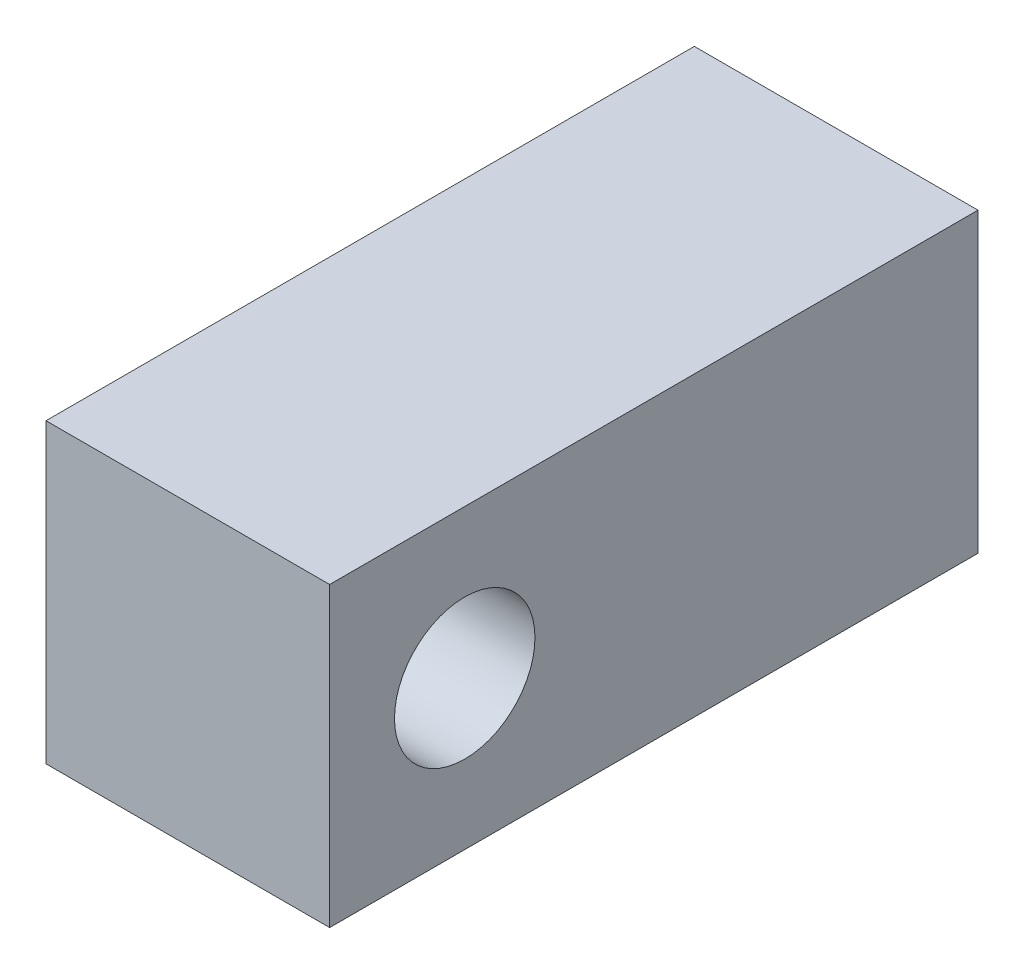
ISO-10303-21;
HEADER;
FILE_DESCRIPTION(('STEP AP214'),'2;1');
FILE_NAME('part.step','',(''),(''),'','','');
FILE_SCHEMA(('AUTOMOTIVE_DESIGN { 1 0 10303 214 1 1 1 1 }'));
ENDSEC;
DATA;
#1=APPLICATION_CONTEXT('core data for automotive mechanical design processes');
#2=APPLICATION_PROTOCOL_DEFINITION('international standard','automotive_design',2000,#1);
#3=PRODUCT_CONTEXT('',#1,'mechanical');
#4=PRODUCT('Part','Part','',(#3));
#5=PRODUCT_RELATED_PRODUCT_CATEGORY('part','',(#4));
#6=PRODUCT_DEFINITION_FORMATION('','',#4);
#7=PRODUCT_DEFINITION_CONTEXT('part definition',#1,'design');
#8=PRODUCT_DEFINITION('design','',#6,#7);
#9=PRODUCT_DEFINITION_SHAPE('','',#8);
#10=(LENGTH_UNIT() NAMED_UNIT(*) SI_UNIT(.MILLI.,.METRE.));
#11=(NAMED_UNIT(*) PLANE_ANGLE_UNIT() SI_UNIT($,.RADIAN.));
#12=(NAMED_UNIT(*) SI_UNIT($,.STERADIAN.) SOLID_ANGLE_UNIT());
#13=UNCERTAINTY_MEASURE_WITH_UNIT(LENGTH_MEASURE(1.E-05),#10,'distance_accuracy_value','');
#14=(GEOMETRIC_REPRESENTATION_CONTEXT(3) GLOBAL_UNCERTAINTY_ASSIGNED_CONTEXT((#13)) GLOBAL_UNIT_ASSIGNED_CONTEXT((#10,
#11,#12)) REPRESENTATION_CONTEXT('',''));
#15=CARTESIAN_POINT('',(0.,0.,0.));
#16=DIRECTION('',(0.,0.,1.));
#17=DIRECTION('',(1.,0.,0.));
#18=AXIS2_PLACEMENT_3D('',#15,#16,#17);
#19=CARTESIAN_POINT('',(37.1122382547684,65.0424365132959,14.9999998733401));
#20=DIRECTION('',(-1.,0.,0.));
#21=DIRECTION('',(0.,0.,-1.));
#22=AXIS2_PLACEMENT_3D('',#19,#20,#21);
#23=PLANE('',#22);
#24=DIRECTION('',(0.,-1.,0.));
#25=VECTOR('',#24,1.);
#26=CARTESIAN_POINT('',(37.1122382547684,71.2424366027028,39.7000002384186));
#27=LINE('',#26,#25);
#28=CARTESIAN_POINT('',(37.1122382547684,71.2424366027028,39.7000002384186));
#29=VERTEX_POINT('',#28);
#30=CARTESIAN_POINT('',(37.1122382547684,58.8424364238889,39.7000002384186));
#31=VERTEX_POINT('',#30);
#32=EDGE_CURVE('E154',#29,#31,#27,.T.);
#33=ORIENTED_EDGE('',*,*,#32,.T.);
#34=DIRECTION('',(0.,0.,-1.));
#35=VECTOR('',#34,1.);
#36=CARTESIAN_POINT('',(37.1122382547684,58.8424364238889,39.7000002384186));
#37=LINE('',#36,#35);
#38=CARTESIAN_POINT('',(37.1122382547684,58.8424364238889,17.299999910593));
#39=VERTEX_POINT('',#38);
#40=EDGE_CURVE('E131',#31,#39,#37,.T.);
#41=ORIENTED_EDGE('',*,*,#40,.T.);
#42=DIRECTION('',(0.,1.,0.));
#43=VECTOR('',#42,1.);
#44=CARTESIAN_POINT('',(37.1122382547684,71.2424366027028,17.299999910593));
#45=LINE('',#44,#43);
#46=CARTESIAN_POINT('',(37.1122382547684,71.2424366027028,17.299999910593));
#47=VERTEX_POINT('',#46);
#48=EDGE_CURVE('E157',#39,#47,#45,.T.);
#49=ORIENTED_EDGE('',*,*,#48,.T.);
#50=DIRECTION('',(0.,0.,1.));
#51=VECTOR('',#50,1.);
#52=CARTESIAN_POINT('',(37.1122382547684,71.2424366027028,39.7000002384186));
#53=LINE('',#52,#51);
#54=EDGE_CURVE('E142',#47,#29,#53,.T.);
#55=ORIENTED_EDGE('',*,*,#54,.T.);
#56=EDGE_LOOP('',(#33,#41,#49,#55));
#57=FACE_BOUND('',#56,.T.);
#58=CARTESIAN_POINT('',(37.1122382547684,65.0424365132959,50.5));
#59=DIRECTION('',(1.,0.,0.));
#60=DIRECTION('',(0.,-1.,0.));
#61=AXIS2_PLACEMENT_3D('',#58,#59,#60);
#62=CIRCLE('',#61,5.2);
#63=CARTESIAN_POINT('',(37.1122382547684,59.8424365132959,50.5));
#64=VERTEX_POINT('',#63);
#65=EDGE_CURVE('E172',#64,#64,#62,.T.);
#66=ORIENTED_EDGE('',*,*,#65,.T.);
#67=EDGE_LOOP('',(#66));
#68=FACE_BOUND('',#67,.T.);
#69=CARTESIAN_POINT('',(37.1122382547684,65.0424365132959,14.4999998360872));
#70=DIRECTION('',(1.,0.,0.));
#71=DIRECTION('',(0.,-1.,0.));
#72=AXIS2_PLACEMENT_3D('',#69,#70,#71);
#73=CIRCLE('',#72,0.999999999999964);
#74=CARTESIAN_POINT('',(37.1122382547684,64.0424365132959,14.4999998360872));
#75=VERTEX_POINT('',#74);
#76=EDGE_CURVE('E179',#75,#75,#73,.T.);
#77=ORIENTED_EDGE('',*,*,#76,.T.);
#78=EDGE_LOOP('',(#77));
#79=FACE_BOUND('',#78,.T.);
#80=CARTESIAN_POINT('',(37.1122382547684,65.0424365132959,42.5000003129244));
#81=DIRECTION('',(1.,0.,0.));
#82=DIRECTION('',(0.,-1.,0.));
#83=AXIS2_PLACEMENT_3D('',#80,#81,#82);
#84=CIRCLE('',#83,0.999999999999968);
#85=CARTESIAN_POINT('',(37.1122382547684,64.0424365132959,42.5000003129244));
#86=VERTEX_POINT('',#85);
#87=EDGE_CURVE('E178',#86,#86,#84,.T.);
#88=ORIENTED_EDGE('',*,*,#87,.T.);
#89=EDGE_LOOP('',(#88));
#90=FACE_BOUND('',#89,.T.);
#91=DIRECTION('',(0.,0.,-1.));
#92=VECTOR('',#91,1.);
#93=CARTESIAN_POINT('',(37.1122382547684,76.0424365132959,60.5));
#94=LINE('',#93,#92);
#95=CARTESIAN_POINT('',(37.1122382547684,76.0424365132959,60.5));
#96=VERTEX_POINT('',#95);
#97=CARTESIAN_POINT('',(37.1122382547684,76.0424365132959,12.5000000745058));
#98=VERTEX_POINT('',#97);
#99=EDGE_CURVE('E224',#96,#98,#94,.T.);
#100=ORIENTED_EDGE('',*,*,#99,.T.);
#101=DIRECTION('',(0.,-1.,0.));
#102=VECTOR('',#101,1.);
#103=CARTESIAN_POINT('',(37.1122382547684,76.0424365132959,12.5000000745058));
#104=LINE('',#103,#102);
#105=CARTESIAN_POINT('',(37.1122382547684,54.0424365132959,12.5000000745058));
#106=VERTEX_POINT('',#105);
#107=EDGE_CURVE('E220',#98,#106,#104,.T.);
#108=ORIENTED_EDGE('',*,*,#107,.T.);
#109=DIRECTION('',(0.,0.,1.));
#110=VECTOR('',#109,1.);
#111=CARTESIAN_POINT('',(37.1122382547684,54.0424365132959,12.5000000745058));
#112=LINE('',#111,#110);
#113=CARTESIAN_POINT('',(37.1122382547684,54.0424365132959,60.5));
#114=VERTEX_POINT('',#113);
#115=EDGE_CURVE('E232',#106,#114,#112,.T.);
#116=ORIENTED_EDGE('',*,*,#115,.T.);
#117=DIRECTION('',(0.,1.,0.));
#118=VECTOR('',#117,1.);
#119=CARTESIAN_POINT('',(37.1122382547684,54.0424365132959,60.5));
#120=LINE('',#119,#118);
#121=EDGE_CURVE('E228',#114,#96,#120,.T.);
#122=ORIENTED_EDGE('',*,*,#121,.T.);
#123=EDGE_LOOP('',(#100,#108,#116,#122));
#124=FACE_BOUND('',#123,.T.);
#125=ADVANCED_FACE('F37',(#57,#68,#79,#90,#124),#23,.T.);
#126=CARTESIAN_POINT('',(-15.6892768072773,76.0424365132959,12.5000000745058));
#127=DIRECTION('',(0.,0.,-1.));
#128=DIRECTION('',(1.,0.,0.));
#129=AXIS2_PLACEMENT_3D('',#126,#127,#128);
#130=PLANE('',#129);
#131=DIRECTION('',(0.,1.,0.));
#132=VECTOR('',#131,1.);
#133=CARTESIAN_POINT('',(54.1122382547684,71.0424365132959,12.5000000745058));
#134=LINE('',#133,#132);
#135=CARTESIAN_POINT('',(54.1122382547684,59.0424365132959,12.5000000745058));
#136=VERTEX_POINT('',#135);
#137=CARTESIAN_POINT('',(54.1122382547684,71.0424365132959,12.5000000745058));
#138=VERTEX_POINT('',#137);
#139=EDGE_CURVE('E186',#136,#138,#134,.T.);
#140=ORIENTED_EDGE('',*,*,#139,.T.);
#141=DIRECTION('',(-1.,0.,0.));
#142=VECTOR('',#141,1.);
#143=CARTESIAN_POINT('',(54.1122382547684,71.0424365132959,12.5000000745058));
#144=LINE('',#143,#142);
#145=CARTESIAN_POINT('',(44.1122382547684,71.0424365132959,12.5000000745058));
#146=VERTEX_POINT('',#145);
#147=EDGE_CURVE('E193',#138,#146,#144,.T.);
#148=ORIENTED_EDGE('',*,*,#147,.T.);
#149=DIRECTION('',(0.,-1.,0.));
#150=VECTOR('',#149,1.);
#151=CARTESIAN_POINT('',(44.1122382547684,71.0424365132959,12.5000000745058));
#152=LINE('',#151,#150);
#153=CARTESIAN_POINT('',(44.1122382547684,59.0424365132959,12.5000000745058));
#154=VERTEX_POINT('',#153);
#155=EDGE_CURVE('E196',#146,#154,#152,.T.);
#156=ORIENTED_EDGE('',*,*,#155,.T.);
#157=DIRECTION('',(1.,0.,0.));
#158=VECTOR('',#157,1.);
#159=CARTESIAN_POINT('',(54.1122382547684,59.0424365132959,12.5000000745058));
#160=LINE('',#159,#158);
#161=EDGE_CURVE('E199',#154,#136,#160,.T.);
#162=ORIENTED_EDGE('',*,*,#161,.T.);
#163=EDGE_LOOP('',(#140,#148,#156,#162));
#164=FACE_BOUND('',#163,.T.);
#165=DIRECTION('',(1.,0.,0.));
#166=VECTOR('',#165,1.);
#167=CARTESIAN_POINT('',(-15.6892768072773,76.0424365132959,12.5000000745058));
#168=LINE('',#167,#166);
#169=CARTESIAN_POINT('',(58.1122382547684,76.0424365132959,12.5000000745058));
#170=VERTEX_POINT('',#169);
#171=EDGE_CURVE('E44',#98,#170,#168,.T.);
#172=ORIENTED_EDGE('',*,*,#171,.T.);
#173=DIRECTION('',(0.,-1.,0.));
#174=VECTOR('',#173,1.);
#175=CARTESIAN_POINT('',(58.1122382547684,76.0424365132959,12.5000000745058));
#176=LINE('',#175,#174);
#177=CARTESIAN_POINT('',(58.1122382547684,54.0424365132959,12.5000000745058));
#178=VERTEX_POINT('',#177);
#179=EDGE_CURVE('E211',#170,#178,#176,.T.);
#180=ORIENTED_EDGE('',*,*,#179,.T.);
#181=DIRECTION('',(1.,0.,0.));
#182=VECTOR('',#181,1.);
#183=CARTESIAN_POINT('',(-15.6892768072773,54.0424365132958,12.5000000745058));
#184=LINE('',#183,#182);
#185=EDGE_CURVE('E223',#106,#178,#184,.T.);
#186=ORIENTED_EDGE('',*,*,#185,.F.);
#187=ORIENTED_EDGE('',*,*,#107,.F.);
#188=EDGE_LOOP('',(#172,#180,#186,#187));
#189=FACE_BOUND('',#188,.T.);
#190=ADVANCED_FACE('F243',(#164,#189),#130,.T.);
#191=CARTESIAN_POINT('',(-15.6892768072773,54.0424365132958,12.5000000745058));
#192=DIRECTION('',(0.,-1.,0.));
#193=DIRECTION('',(1.,0.,0.));
#194=AXIS2_PLACEMENT_3D('',#191,#192,#193);
#195=PLANE('',#194);
#196=ORIENTED_EDGE('',*,*,#185,.T.);
#197=DIRECTION('',(0.,0.,1.));
#198=VECTOR('',#197,1.);
#199=CARTESIAN_POINT('',(58.1122382547684,54.0424365132959,12.5000000745058));
#200=LINE('',#199,#198);
#201=CARTESIAN_POINT('',(58.1122382547684,54.0424365132959,60.5));
#202=VERTEX_POINT('',#201);
#203=EDGE_CURVE('E214',#178,#202,#200,.T.);
#204=ORIENTED_EDGE('',*,*,#203,.T.);
#205=DIRECTION('',(1.,0.,0.));
#206=VECTOR('',#205,1.);
#207=CARTESIAN_POINT('',(-15.6892768072773,54.0424365132958,60.5));
#208=LINE('',#207,#206);
#209=EDGE_CURVE('E231',#114,#202,#208,.T.);
#210=ORIENTED_EDGE('',*,*,#209,.F.);
#211=ORIENTED_EDGE('',*,*,#115,.F.);
#212=EDGE_LOOP('',(#196,#204,#210,#211));
#213=FACE_BOUND('',#212,.T.);
#214=ADVANCED_FACE('F252',(#213),#195,.T.);
#215=CARTESIAN_POINT('',(-15.6892768072773,54.0424365132958,60.5));
#216=DIRECTION('',(0.,0.,1.));
#217=DIRECTION('',(-1.,0.,0.));
#218=AXIS2_PLACEMENT_3D('',#215,#216,#217);
#219=PLANE('',#218);
#220=ORIENTED_EDGE('',*,*,#209,.T.);
#221=DIRECTION('',(0.,1.,0.));
#222=VECTOR('',#221,1.);
#223=CARTESIAN_POINT('',(58.1122382547684,54.0424365132959,60.5));
#224=LINE('',#223,#222);
#225=CARTESIAN_POINT('',(58.1122382547684,76.0424365132959,60.5));
#226=VERTEX_POINT('',#225);
#227=EDGE_CURVE('E217',#202,#226,#224,.T.);
#228=ORIENTED_EDGE('',*,*,#227,.T.);
#229=DIRECTION('',(1.,0.,0.));
#230=VECTOR('',#229,1.);
#231=CARTESIAN_POINT('',(-15.6892768072773,76.0424365132959,60.5));
#232=LINE('',#231,#230);
#233=EDGE_CURVE('E227',#96,#226,#232,.T.);
#234=ORIENTED_EDGE('',*,*,#233,.F.);
#235=ORIENTED_EDGE('',*,*,#121,.F.);
#236=EDGE_LOOP('',(#220,#228,#234,#235));
#237=FACE_BOUND('',#236,.T.);
#238=ADVANCED_FACE('F256',(#237),#219,.T.);
#239=CARTESIAN_POINT('',(-15.6892768072773,76.0424365132959,60.5));
#240=DIRECTION('',(0.,1.,0.));
#241=DIRECTION('',(-1.,0.,0.));
#242=AXIS2_PLACEMENT_3D('',#239,#240,#241);
#243=PLANE('',#242);
#244=ORIENTED_EDGE('',*,*,#233,.T.);
#245=DIRECTION('',(0.,0.,-1.));
#246=VECTOR('',#245,1.);
#247=CARTESIAN_POINT('',(58.1122382547684,76.0424365132959,60.5));
#248=LINE('',#247,#246);
#249=EDGE_CURVE('E204',#226,#170,#248,.T.);
#250=ORIENTED_EDGE('',*,*,#249,.T.);
#251=ORIENTED_EDGE('',*,*,#171,.F.);
#252=ORIENTED_EDGE('',*,*,#99,.F.);
#253=EDGE_LOOP('',(#244,#250,#251,#252));
#254=FACE_BOUND('',#253,.T.);
#255=ADVANCED_FACE('F247',(#254),#243,.T.);
#256=CARTESIAN_POINT('',(58.1122382547684,0.,0.));
#257=DIRECTION('',(1.,0.,0.));
#258=DIRECTION('',(0.,1.,0.));
#259=AXIS2_PLACEMENT_3D('',#256,#257,#258);
#260=PLANE('',#259);
#261=CARTESIAN_POINT('',(58.1122382547684,65.0424365132959,50.5));
#262=DIRECTION('',(-1.,0.,0.));
#263=DIRECTION('',(0.,1.,0.));
#264=AXIS2_PLACEMENT_3D('',#261,#262,#263);
#265=CIRCLE('',#264,5.2);
#266=CARTESIAN_POINT('',(58.1122382547684,70.2424365132959,50.5));
#267=VERTEX_POINT('',#266);
#268=EDGE_CURVE('E175',#267,#267,#265,.F.);
#269=ORIENTED_EDGE('',*,*,#268,.F.);
#270=EDGE_LOOP('',(#269));
#271=FACE_BOUND('',#270,.T.);
#272=ORIENTED_EDGE('',*,*,#249,.F.);
#273=ORIENTED_EDGE('',*,*,#227,.F.);
#274=ORIENTED_EDGE('',*,*,#203,.F.);
#275=ORIENTED_EDGE('',*,*,#179,.F.);
#276=EDGE_LOOP('',(#272,#273,#274,#275));
#277=FACE_BOUND('',#276,.T.);
#278=ADVANCED_FACE('F249',(#271,#277),#260,.T.);
#279=CARTESIAN_POINT('',(54.1122382547684,71.0424365132959,17.5000000745058));
#280=DIRECTION('',(1.,0.,0.));
#281=DIRECTION('',(0.,0.,1.));
#282=AXIS2_PLACEMENT_3D('',#279,#280,#281);
#283=PLANE('',#282);
#284=DIRECTION('',(0.,0.,-1.));
#285=VECTOR('',#284,1.);
#286=CARTESIAN_POINT('',(54.1122382547684,71.0424365132959,17.5000000745058));
#287=LINE('',#286,#285);
#288=CARTESIAN_POINT('',(54.1122382547684,71.0424365132959,17.299999910593));
#289=VERTEX_POINT('',#288);
#290=EDGE_CURVE('E59',#289,#138,#287,.T.);
#291=ORIENTED_EDGE('',*,*,#290,.T.);
#292=ORIENTED_EDGE('',*,*,#139,.F.);
#293=DIRECTION('',(0.,0.,-1.));
#294=VECTOR('',#293,1.);
#295=CARTESIAN_POINT('',(54.1122382547684,59.0424365132959,17.5000000745058));
#296=LINE('',#295,#294);
#297=CARTESIAN_POINT('',(54.1122382547684,59.0424365132959,17.299999910593));
#298=VERTEX_POINT('',#297);
#299=EDGE_CURVE('E202',#298,#136,#296,.T.);
#300=ORIENTED_EDGE('',*,*,#299,.F.);
#301=DIRECTION('',(0.,1.,0.));
#302=VECTOR('',#301,1.);
#303=CARTESIAN_POINT('',(54.1122382547684,71.2424366027028,17.299999910593));
#304=LINE('',#303,#302);
#305=CARTESIAN_POINT('',(54.1122382547684,58.8424364238889,17.299999910593));
#306=VERTEX_POINT('',#305);
#307=EDGE_CURVE('E147',#306,#298,#304,.T.);
#308=ORIENTED_EDGE('',*,*,#307,.F.);
#309=DIRECTION('',(0.,0.,-1.));
#310=VECTOR('',#309,1.);
#311=CARTESIAN_POINT('',(54.1122382547684,58.8424364238889,39.7000002384186));
#312=LINE('',#311,#310);
#313=CARTESIAN_POINT('',(54.1122382547684,58.8424364238889,39.7000002384186));
#314=VERTEX_POINT('',#313);
#315=EDGE_CURVE('E128',#314,#306,#312,.T.);
#316=ORIENTED_EDGE('',*,*,#315,.F.);
#317=DIRECTION('',(0.,-1.,0.));
#318=VECTOR('',#317,1.);
#319=CARTESIAN_POINT('',(54.1122382547684,71.2424366027028,39.7000002384186));
#320=LINE('',#319,#318);
#321=CARTESIAN_POINT('',(54.1122382547684,71.2424366027028,39.7000002384186));
#322=VERTEX_POINT('',#321);
#323=EDGE_CURVE('E137',#322,#314,#320,.T.);
#324=ORIENTED_EDGE('',*,*,#323,.F.);
#325=DIRECTION('',(0.,0.,1.));
#326=VECTOR('',#325,1.);
#327=CARTESIAN_POINT('',(54.1122382547684,71.2424366027028,39.7000002384186));
#328=LINE('',#327,#326);
#329=CARTESIAN_POINT('',(54.1122382547684,71.2424366027028,17.299999910593));
#330=VERTEX_POINT('',#329);
#331=EDGE_CURVE('E134',#330,#322,#328,.T.);
#332=ORIENTED_EDGE('',*,*,#331,.F.);
#333=EDGE_CURVE('E148',#289,#330,#304,.T.);
#334=ORIENTED_EDGE('',*,*,#333,.F.);
#335=EDGE_LOOP('',(#291,#292,#300,#308,#316,#324,#332,#334));
#336=FACE_BOUND('',#335,.T.);
#337=ADVANCED_FACE('F144',(#336),#283,.F.);
#338=CARTESIAN_POINT('',(54.1122382547684,59.0424365132959,17.5000000745058));
#339=DIRECTION('',(0.,-1.,0.));
#340=DIRECTION('',(0.,0.,1.));
#341=AXIS2_PLACEMENT_3D('',#338,#339,#340);
#342=PLANE('',#341);
#343=ORIENTED_EDGE('',*,*,#299,.T.);
#344=ORIENTED_EDGE('',*,*,#161,.F.);
#345=DIRECTION('',(0.,0.,-1.));
#346=VECTOR('',#345,1.);
#347=CARTESIAN_POINT('',(44.1122382547684,59.0424365132959,17.5000000745058));
#348=LINE('',#347,#346);
#349=CARTESIAN_POINT('',(44.1122382547684,59.0424365132959,17.299999910593));
#350=VERTEX_POINT('',#349);
#351=EDGE_CURVE('E205',#350,#154,#348,.T.);
#352=ORIENTED_EDGE('',*,*,#351,.F.);
#353=DIRECTION('',(-1.,0.,0.));
#354=VECTOR('',#353,1.);
#355=CARTESIAN_POINT('',(54.1122382547684,59.0424365132959,17.299999910593));
#356=LINE('',#355,#354);
#357=EDGE_CURVE('E169',#298,#350,#356,.T.);
#358=ORIENTED_EDGE('',*,*,#357,.F.);
#359=EDGE_LOOP('',(#343,#344,#352,#358));
#360=FACE_BOUND('',#359,.T.);
#361=ADVANCED_FACE('F296',(#360),#342,.F.);
#362=CARTESIAN_POINT('',(44.1122382547684,71.0424365132959,17.5000000745058));
#363=DIRECTION('',(-1.,0.,0.));
#364=DIRECTION('',(0.,0.,-1.));
#365=AXIS2_PLACEMENT_3D('',#362,#363,#364);
#366=PLANE('',#365);
#367=CARTESIAN_POINT('',(44.1122382547684,65.0424365132959,14.4999998360872));
#368=DIRECTION('',(1.,0.,0.));
#369=DIRECTION('',(0.,0.,-1.));
#370=AXIS2_PLACEMENT_3D('',#367,#368,#369);
#371=CIRCLE('',#370,0.999999999999964);
#372=CARTESIAN_POINT('',(44.1122382547684,64.0424365132959,14.4999998360872));
#373=VERTEX_POINT('',#372);
#374=EDGE_CURVE('E182',#373,#373,#371,.F.);
#375=ORIENTED_EDGE('',*,*,#374,.T.);
#376=EDGE_LOOP('',(#375));
#377=FACE_BOUND('',#376,.T.);
#378=ORIENTED_EDGE('',*,*,#351,.T.);
#379=ORIENTED_EDGE('',*,*,#155,.F.);
#380=DIRECTION('',(0.,0.,-1.));
#381=VECTOR('',#380,1.);
#382=CARTESIAN_POINT('',(44.1122382547684,71.0424365132959,17.5000000745058));
#383=LINE('',#382,#381);
#384=CARTESIAN_POINT('',(44.1122382547684,71.0424365132959,17.299999910593));
#385=VERTEX_POINT('',#384);
#386=EDGE_CURVE('E207',#385,#146,#383,.T.);
#387=ORIENTED_EDGE('',*,*,#386,.F.);
#388=DIRECTION('',(0.,1.,0.));
#389=VECTOR('',#388,1.);
#390=CARTESIAN_POINT('',(44.1122382547684,71.0424365132959,17.299999910593));
#391=LINE('',#390,#389);
#392=EDGE_CURVE('E163',#350,#385,#391,.T.);
#393=ORIENTED_EDGE('',*,*,#392,.F.);
#394=EDGE_LOOP('',(#378,#379,#387,#393));
#395=FACE_BOUND('',#394,.T.);
#396=ADVANCED_FACE('F299',(#377,#395),#366,.F.);
#397=CARTESIAN_POINT('',(54.1122382547684,71.0424365132959,17.5000000745058));
#398=DIRECTION('',(0.,1.,0.));
#399=DIRECTION('',(0.,0.,-1.));
#400=AXIS2_PLACEMENT_3D('',#397,#398,#399);
#401=PLANE('',#400);
#402=ORIENTED_EDGE('',*,*,#386,.T.);
#403=ORIENTED_EDGE('',*,*,#147,.F.);
#404=ORIENTED_EDGE('',*,*,#290,.F.);
#405=DIRECTION('',(1.,0.,0.));
#406=VECTOR('',#405,1.);
#407=CARTESIAN_POINT('',(54.1122382547684,71.0424365132959,17.299999910593));
#408=LINE('',#407,#406);
#409=EDGE_CURVE('E11',#385,#289,#408,.T.);
#410=ORIENTED_EDGE('',*,*,#409,.F.);
#411=EDGE_LOOP('',(#402,#403,#404,#410));
#412=FACE_BOUND('',#411,.T.);
#413=ADVANCED_FACE('F291',(#412),#401,.F.);
#414=CARTESIAN_POINT('',(46.9406653795145,65.0424365132959,14.4999998360872));
#415=DIRECTION('',(-1.,0.,0.));
#416=DIRECTION('',(0.,-1.,0.));
#417=AXIS2_PLACEMENT_3D('',#414,#415,#416);
#418=CYLINDRICAL_SURFACE('',#417,0.999999999999964);
#419=CARTESIAN_POINT('',(44.1122382547684,64.0424365132959,14.4999998360872));
#420=CARTESIAN_POINT('',(44.0393215881017,64.0424365132959,14.4999998360872));
#421=CARTESIAN_POINT('',(43.9664049214351,64.0424365132959,14.4999998360872));
#422=CARTESIAN_POINT('',(43.8205715881017,64.0424365132959,14.4999998360872));
#423=CARTESIAN_POINT('',(43.7476549214351,64.0424365132959,14.4999998360872));
#424=CARTESIAN_POINT('',(43.6018215881017,64.0424365132959,14.4999998360872));
#425=CARTESIAN_POINT('',(43.5289049214351,64.0424365132959,14.4999998360872));
#426=CARTESIAN_POINT('',(43.3830715881017,64.0424365132959,14.4999998360872));
#427=CARTESIAN_POINT('',(43.3101549214351,64.0424365132959,14.4999998360872));
#428=CARTESIAN_POINT('',(43.1643215881017,64.0424365132959,14.4999998360872));
#429=CARTESIAN_POINT('',(43.0914049214351,64.0424365132959,14.4999998360872));
#430=CARTESIAN_POINT('',(42.9455715881017,64.0424365132959,14.4999998360872));
#431=CARTESIAN_POINT('',(42.8726549214351,64.0424365132959,14.4999998360872));
#432=CARTESIAN_POINT('',(42.7268215881017,64.0424365132959,14.4999998360872));
#433=CARTESIAN_POINT('',(42.6539049214351,64.0424365132959,14.4999998360872));
#434=CARTESIAN_POINT('',(42.5080715881017,64.0424365132959,14.4999998360872));
#435=CARTESIAN_POINT('',(42.4351549214351,64.0424365132959,14.4999998360872));
#436=CARTESIAN_POINT('',(42.2893215881017,64.0424365132959,14.4999998360872));
#437=CARTESIAN_POINT('',(42.2164049214351,64.0424365132959,14.4999998360872));
#438=CARTESIAN_POINT('',(42.0705715881017,64.0424365132959,14.4999998360872));
#439=CARTESIAN_POINT('',(41.9976549214351,64.0424365132959,14.4999998360872));
#440=CARTESIAN_POINT('',(41.8518215881017,64.0424365132959,14.4999998360872));
#441=CARTESIAN_POINT('',(41.7789049214351,64.0424365132959,14.4999998360872));
#442=CARTESIAN_POINT('',(41.6330715881017,64.0424365132959,14.4999998360872));
#443=CARTESIAN_POINT('',(41.5601549214351,64.0424365132959,14.4999998360872));
#444=CARTESIAN_POINT('',(41.4143215881017,64.0424365132959,14.4999998360872));
#445=CARTESIAN_POINT('',(41.3414049214351,64.0424365132959,14.4999998360872));
#446=CARTESIAN_POINT('',(41.1955715881017,64.0424365132959,14.4999998360872));
#447=CARTESIAN_POINT('',(41.1226549214351,64.0424365132959,14.4999998360872));
#448=CARTESIAN_POINT('',(40.9768215881017,64.0424365132959,14.4999998360872));
#449=CARTESIAN_POINT('',(40.9039049214351,64.0424365132959,14.4999998360872));
#450=CARTESIAN_POINT('',(40.7580715881017,64.0424365132959,14.4999998360872));
#451=CARTESIAN_POINT('',(40.6851549214351,64.0424365132959,14.4999998360872));
#452=CARTESIAN_POINT('',(40.5393215881017,64.0424365132959,14.4999998360872));
#453=CARTESIAN_POINT('',(40.4664049214351,64.0424365132959,14.4999998360872));
#454=CARTESIAN_POINT('',(40.3205715881017,64.0424365132959,14.4999998360872));
#455=CARTESIAN_POINT('',(40.2476549214351,64.0424365132959,14.4999998360872));
#456=CARTESIAN_POINT('',(40.1018215881017,64.0424365132959,14.4999998360872));
#457=CARTESIAN_POINT('',(40.0289049214351,64.0424365132959,14.4999998360872));
#458=CARTESIAN_POINT('',(39.8830715881017,64.0424365132959,14.4999998360872));
#459=CARTESIAN_POINT('',(39.8101549214351,64.0424365132959,14.4999998360872));
#460=CARTESIAN_POINT('',(39.6643215881017,64.0424365132959,14.4999998360872));
#461=CARTESIAN_POINT('',(39.5914049214351,64.0424365132959,14.4999998360872));
#462=CARTESIAN_POINT('',(39.4455715881017,64.0424365132959,14.4999998360872));
#463=CARTESIAN_POINT('',(39.3726549214351,64.0424365132959,14.4999998360872));
#464=CARTESIAN_POINT('',(39.2268215881017,64.0424365132959,14.4999998360872));
#465=CARTESIAN_POINT('',(39.1539049214351,64.0424365132959,14.4999998360872));
#466=CARTESIAN_POINT('',(39.0080715881017,64.0424365132959,14.4999998360872));
#467=CARTESIAN_POINT('',(38.9351549214351,64.0424365132959,14.4999998360872));
#468=CARTESIAN_POINT('',(38.7893215881017,64.0424365132959,14.4999998360872));
#469=CARTESIAN_POINT('',(38.7164049214351,64.0424365132959,14.4999998360872));
#470=CARTESIAN_POINT('',(38.5705715881017,64.0424365132959,14.4999998360872));
#471=CARTESIAN_POINT('',(38.4976549214351,64.0424365132959,14.4999998360872));
#472=CARTESIAN_POINT('',(38.3518215881017,64.0424365132959,14.4999998360872));
#473=CARTESIAN_POINT('',(38.2789049214351,64.0424365132959,14.4999998360872));
#474=CARTESIAN_POINT('',(38.1330715881017,64.0424365132959,14.4999998360872));
#475=CARTESIAN_POINT('',(38.0601549214351,64.0424365132959,14.4999998360872));
#476=CARTESIAN_POINT('',(37.9143215881017,64.0424365132959,14.4999998360872));
#477=CARTESIAN_POINT('',(37.8414049214351,64.0424365132959,14.4999998360872));
#478=CARTESIAN_POINT('',(37.6955715881017,64.0424365132959,14.4999998360872));
#479=CARTESIAN_POINT('',(37.6226549214351,64.0424365132959,14.4999998360872));
#480=CARTESIAN_POINT('',(37.4768215881017,64.0424365132959,14.4999998360872));
#481=CARTESIAN_POINT('',(37.4039049214351,64.0424365132959,14.4999998360872));
#482=CARTESIAN_POINT('',(37.2580715881017,64.0424365132959,14.4999998360872));
#483=CARTESIAN_POINT('',(37.1851549214351,64.0424365132959,14.4999998360872));
#484=CARTESIAN_POINT('',(37.1122382547684,64.0424365132959,14.4999998360872));
#485=B_SPLINE_CURVE_WITH_KNOTS('',3,(#419,#420,#421,#422,#423,#424,#425,#426,#427,#428,#429,
#430,#431,#432,#433,#434,#435,#436,#437,#438,#439,#440,#441,#442,#443,#444,#445,#446,#447,#448,
#449,#450,#451,#452,#453,#454,#455,#456,#457,#458,#459,#460,#461,#462,#463,#464,#465,#466,#467,
#468,#469,#470,#471,#472,#473,#474,#475,#476,#477,#478,#479,#480,#481,#482,#483,#484),
.UNSPECIFIED.,.F.,.F.,(4,2,2,2,2,2,2,2,2,2,2,2,2,2,2,2,2,2,2,2,2,2,2,2,2,2,2,2,2,2,2,2,4),(0.,
0.218750000000004,0.4375,0.656250000000004,0.875000000000001,1.09375,1.3125,1.53125,1.75,
1.96875,2.1875,2.40625,2.625,2.84375,3.0625,3.28125,3.5,3.71875,3.9375,4.15625,4.375,4.59375,
4.8125,5.03124999999999,5.25,5.46874999999999,5.6875,5.90624999999999,6.125,6.34375,
6.56249999999999,6.78125,6.99999999999999),.UNSPECIFIED.);
#486=EDGE_CURVE('BSEAM281',#373,#75,#485,.T.);
#487=ORIENTED_EDGE('',*,*,#374,.F.);
#488=ORIENTED_EDGE('',*,*,#76,.F.);
#489=ORIENTED_EDGE('',*,*,#486,.T.);
#490=ORIENTED_EDGE('',*,*,#486,.F.);
#491=EDGE_LOOP('',(#487,#489,#488,#490));
#492=FACE_BOUND('',#491,.T.);
#493=ADVANCED_FACE('F281',(#492),#418,.F.);
#494=CARTESIAN_POINT('',(46.9406653795145,65.0424365132959,42.5000003129244));
#495=DIRECTION('',(-1.,0.,0.));
#496=DIRECTION('',(0.,-1.,0.));
#497=AXIS2_PLACEMENT_3D('',#494,#495,#496);
#498=CYLINDRICAL_SURFACE('',#497,0.999999999999968);
#499=CARTESIAN_POINT('',(44.1122382547684,65.0424365132959,42.5000003129244));
#500=DIRECTION('',(1.,0.,0.));
#501=DIRECTION('',(0.,0.,-1.));
#502=AXIS2_PLACEMENT_3D('',#499,#500,#501);
#503=CIRCLE('',#502,0.999999999999968);
#504=CARTESIAN_POINT('',(44.1122382547684,64.0424365132959,42.5000003129244));
#505=VERTEX_POINT('',#504);
#506=EDGE_CURVE('E183',#505,#505,#503,.F.);
#507=CARTESIAN_POINT('',(44.1122382547684,64.0424365132959,42.5000003129244));
#508=CARTESIAN_POINT('',(44.0393215881017,64.0424365132959,42.5000003129244));
#509=CARTESIAN_POINT('',(43.9664049214351,64.0424365132959,42.5000003129244));
#510=CARTESIAN_POINT('',(43.8205715881017,64.0424365132959,42.5000003129244));
#511=CARTESIAN_POINT('',(43.7476549214351,64.0424365132959,42.5000003129244));
#512=CARTESIAN_POINT('',(43.6018215881017,64.0424365132959,42.5000003129244));
#513=CARTESIAN_POINT('',(43.5289049214351,64.0424365132959,42.5000003129244));
#514=CARTESIAN_POINT('',(43.3830715881017,64.0424365132959,42.5000003129244));
#515=CARTESIAN_POINT('',(43.3101549214351,64.0424365132959,42.5000003129244));
#516=CARTESIAN_POINT('',(43.1643215881017,64.0424365132959,42.5000003129244));
#517=CARTESIAN_POINT('',(43.0914049214351,64.0424365132959,42.5000003129244));
#518=CARTESIAN_POINT('',(42.9455715881017,64.0424365132959,42.5000003129244));
#519=CARTESIAN_POINT('',(42.8726549214351,64.0424365132959,42.5000003129244));
#520=CARTESIAN_POINT('',(42.7268215881017,64.0424365132959,42.5000003129244));
#521=CARTESIAN_POINT('',(42.6539049214351,64.0424365132959,42.5000003129244));
#522=CARTESIAN_POINT('',(42.5080715881017,64.0424365132959,42.5000003129244));
#523=CARTESIAN_POINT('',(42.4351549214351,64.0424365132959,42.5000003129244));
#524=CARTESIAN_POINT('',(42.2893215881017,64.0424365132959,42.5000003129244));
#525=CARTESIAN_POINT('',(42.2164049214351,64.0424365132959,42.5000003129244));
#526=CARTESIAN_POINT('',(42.0705715881017,64.0424365132959,42.5000003129244));
#527=CARTESIAN_POINT('',(41.9976549214351,64.0424365132959,42.5000003129244));
#528=CARTESIAN_POINT('',(41.8518215881017,64.0424365132959,42.5000003129244));
#529=CARTESIAN_POINT('',(41.7789049214351,64.0424365132959,42.5000003129244));
#530=CARTESIAN_POINT('',(41.6330715881017,64.0424365132959,42.5000003129244));
#531=CARTESIAN_POINT('',(41.5601549214351,64.0424365132959,42.5000003129244));
#532=CARTESIAN_POINT('',(41.4143215881017,64.0424365132959,42.5000003129244));
#533=CARTESIAN_POINT('',(41.3414049214351,64.0424365132959,42.5000003129244));
#534=CARTESIAN_POINT('',(41.1955715881017,64.0424365132959,42.5000003129244));
#535=CARTESIAN_POINT('',(41.1226549214351,64.0424365132959,42.5000003129244));
#536=CARTESIAN_POINT('',(40.9768215881017,64.0424365132959,42.5000003129244));
#537=CARTESIAN_POINT('',(40.9039049214351,64.0424365132959,42.5000003129244));
#538=CARTESIAN_POINT('',(40.7580715881017,64.0424365132959,42.5000003129244));
#539=CARTESIAN_POINT('',(40.6851549214351,64.0424365132959,42.5000003129244));
#540=CARTESIAN_POINT('',(40.5393215881017,64.0424365132959,42.5000003129244));
#541=CARTESIAN_POINT('',(40.4664049214351,64.0424365132959,42.5000003129244));
#542=CARTESIAN_POINT('',(40.3205715881017,64.0424365132959,42.5000003129244));
#543=CARTESIAN_POINT('',(40.2476549214351,64.0424365132959,42.5000003129244));
#544=CARTESIAN_POINT('',(40.1018215881017,64.0424365132959,42.5000003129244));
#545=CARTESIAN_POINT('',(40.0289049214351,64.0424365132959,42.5000003129244));
#546=CARTESIAN_POINT('',(39.8830715881017,64.0424365132959,42.5000003129244));
#547=CARTESIAN_POINT('',(39.8101549214351,64.0424365132959,42.5000003129244));
#548=CARTESIAN_POINT('',(39.6643215881017,64.0424365132959,42.5000003129244));
#549=CARTESIAN_POINT('',(39.5914049214351,64.0424365132959,42.5000003129244));
#550=CARTESIAN_POINT('',(39.4455715881017,64.0424365132959,42.5000003129244));
#551=CARTESIAN_POINT('',(39.3726549214351,64.0424365132959,42.5000003129244));
#552=CARTESIAN_POINT('',(39.2268215881017,64.0424365132959,42.5000003129244));
#553=CARTESIAN_POINT('',(39.1539049214351,64.0424365132959,42.5000003129244));
#554=CARTESIAN_POINT('',(39.0080715881017,64.0424365132959,42.5000003129244));
#555=CARTESIAN_POINT('',(38.9351549214351,64.0424365132959,42.5000003129244));
#556=CARTESIAN_POINT('',(38.7893215881017,64.0424365132959,42.5000003129244));
#557=CARTESIAN_POINT('',(38.7164049214351,64.0424365132959,42.5000003129244));
#558=CARTESIAN_POINT('',(38.5705715881017,64.0424365132959,42.5000003129244));
#559=CARTESIAN_POINT('',(38.4976549214351,64.0424365132959,42.5000003129244));
#560=CARTESIAN_POINT('',(38.3518215881017,64.0424365132959,42.5000003129244));
#561=CARTESIAN_POINT('',(38.2789049214351,64.0424365132959,42.5000003129244));
#562=CARTESIAN_POINT('',(38.1330715881017,64.0424365132959,42.5000003129244));
#563=CARTESIAN_POINT('',(38.0601549214351,64.0424365132959,42.5000003129244));
#564=CARTESIAN_POINT('',(37.9143215881017,64.0424365132959,42.5000003129244));
#565=CARTESIAN_POINT('',(37.8414049214351,64.0424365132959,42.5000003129244));
#566=CARTESIAN_POINT('',(37.6955715881017,64.0424365132959,42.5000003129244));
#567=CARTESIAN_POINT('',(37.6226549214351,64.0424365132959,42.5000003129244));
#568=CARTESIAN_POINT('',(37.4768215881017,64.0424365132959,42.5000003129244));
#569=CARTESIAN_POINT('',(37.4039049214351,64.0424365132959,42.5000003129244));
#570=CARTESIAN_POINT('',(37.2580715881017,64.0424365132959,42.5000003129244));
#571=CARTESIAN_POINT('',(37.1851549214351,64.0424365132959,42.5000003129244));
#572=CARTESIAN_POINT('',(37.1122382547684,64.0424365132959,42.5000003129244));
#573=B_SPLINE_CURVE_WITH_KNOTS('',3,(#507,#508,#509,#510,#511,#512,#513,#514,#515,#516,#517,
#518,#519,#520,#521,#522,#523,#524,#525,#526,#527,#528,#529,#530,#531,#532,#533,#534,#535,#536,
#537,#538,#539,#540,#541,#542,#543,#544,#545,#546,#547,#548,#549,#550,#551,#552,#553,#554,#555,
#556,#557,#558,#559,#560,#561,#562,#563,#564,#565,#566,#567,#568,#569,#570,#571,#572),
.UNSPECIFIED.,.F.,.F.,(4,2,2,2,2,2,2,2,2,2,2,2,2,2,2,2,2,2,2,2,2,2,2,2,2,2,2,2,2,2,2,2,4),(0.,
0.218750000000004,0.4375,0.656250000000004,0.875000000000001,1.09375,1.3125,1.53125,1.75,
1.96875,2.1875,2.40625,2.625,2.84375,3.0625,3.28125,3.5,3.71875,3.9375,4.15625,4.375,4.59375,
4.8125,5.03124999999999,5.25,5.46874999999999,5.6875,5.90624999999999,6.125,6.34375,
6.56249999999999,6.78125,6.99999999999999),.UNSPECIFIED.);
#574=EDGE_CURVE('BSEAM278',#505,#86,#573,.T.);
#575=ORIENTED_EDGE('',*,*,#506,.F.);
#576=ORIENTED_EDGE('',*,*,#87,.F.);
#577=ORIENTED_EDGE('',*,*,#574,.T.);
#578=ORIENTED_EDGE('',*,*,#574,.F.);
#579=EDGE_LOOP('',(#575,#577,#576,#578));
#580=FACE_BOUND('',#579,.T.);
#581=ADVANCED_FACE('F278',(#580),#498,.F.);
#582=CARTESIAN_POINT('',(44.1122382547684,71.0424365132959,17.5000000745058));
#583=DIRECTION('',(-1.,0.,0.));
#584=DIRECTION('',(0.,0.,-1.));
#585=AXIS2_PLACEMENT_3D('',#582,#583,#584);
#586=PLANE('',#585);
#587=ORIENTED_EDGE('',*,*,#506,.T.);
#588=EDGE_LOOP('',(#587));
#589=FACE_BOUND('',#588,.T.);
#590=ADVANCED_FACE('F280',(#589),#586,.T.);
#591=CARTESIAN_POINT('',(72.8200593034486,65.0424365132959,50.5));
#592=DIRECTION('',(-1.,0.,0.));
#593=DIRECTION('',(0.,-1.,0.));
#594=AXIS2_PLACEMENT_3D('',#591,#592,#593);
#595=CYLINDRICAL_SURFACE('',#594,5.2);
#596=ORIENTED_EDGE('',*,*,#65,.F.);
#597=EDGE_LOOP('',(#596));
#598=FACE_BOUND('',#597,.T.);
#599=ORIENTED_EDGE('',*,*,#268,.T.);
#600=EDGE_LOOP('',(#599));
#601=FACE_BOUND('',#600,.T.);
#602=ADVANCED_FACE('F288',(#598,#601),#595,.F.);
#603=CARTESIAN_POINT('',(54.1122382547684,71.2424366027028,17.299999910593));
#604=DIRECTION('',(0.,0.,-1.));
#605=DIRECTION('',(1.,0.,0.));
#606=AXIS2_PLACEMENT_3D('',#603,#604,#605);
#607=PLANE('',#606);
#608=ORIENTED_EDGE('',*,*,#307,.T.);
#609=ORIENTED_EDGE('',*,*,#357,.T.);
#610=ORIENTED_EDGE('',*,*,#392,.T.);
#611=ORIENTED_EDGE('',*,*,#409,.T.);
#612=ORIENTED_EDGE('',*,*,#333,.T.);
#613=DIRECTION('',(-1.,0.,0.));
#614=VECTOR('',#613,1.);
#615=CARTESIAN_POINT('',(54.1122382547684,71.2424366027028,17.299999910593));
#616=LINE('',#615,#614);
#617=EDGE_CURVE('E164',#330,#47,#616,.T.);
#618=ORIENTED_EDGE('',*,*,#617,.T.);
#619=ORIENTED_EDGE('',*,*,#48,.F.);
#620=DIRECTION('',(-1.,0.,0.));
#621=VECTOR('',#620,1.);
#622=CARTESIAN_POINT('',(54.1122382547684,58.8424364238889,17.299999910593));
#623=LINE('',#622,#621);
#624=EDGE_CURVE('E133',#306,#39,#623,.T.);
#625=ORIENTED_EDGE('',*,*,#624,.F.);
#626=EDGE_LOOP('',(#608,#609,#610,#611,#612,#618,#619,#625));
#627=FACE_BOUND('',#626,.T.);
#628=ADVANCED_FACE('F316',(#627),#607,.F.);
#629=CARTESIAN_POINT('',(54.1122382547684,71.2424366027028,39.7000002384186));
#630=DIRECTION('',(0.,0.,1.));
#631=DIRECTION('',(-1.,0.,0.));
#632=AXIS2_PLACEMENT_3D('',#629,#630,#631);
#633=PLANE('',#632);
#634=ORIENTED_EDGE('',*,*,#32,.F.);
#635=DIRECTION('',(-1.,0.,0.));
#636=VECTOR('',#635,1.);
#637=CARTESIAN_POINT('',(54.1122382547684,71.2424366027028,39.7000002384186));
#638=LINE('',#637,#636);
#639=EDGE_CURVE('E139',#322,#29,#638,.T.);
#640=ORIENTED_EDGE('',*,*,#639,.F.);
#641=ORIENTED_EDGE('',*,*,#323,.T.);
#642=DIRECTION('',(-1.,0.,0.));
#643=VECTOR('',#642,1.);
#644=CARTESIAN_POINT('',(54.1122382547684,58.8424364238889,39.7000002384186));
#645=LINE('',#644,#643);
#646=EDGE_CURVE('E51',#314,#31,#645,.T.);
#647=ORIENTED_EDGE('',*,*,#646,.T.);
#648=EDGE_LOOP('',(#634,#640,#641,#647));
#649=FACE_BOUND('',#648,.T.);
#650=ADVANCED_FACE('F138',(#649),#633,.F.);
#651=CARTESIAN_POINT('',(54.1122382547684,71.2424366027028,39.7000002384186));
#652=DIRECTION('',(0.,1.,0.));
#653=DIRECTION('',(-1.,0.,0.));
#654=AXIS2_PLACEMENT_3D('',#651,#652,#653);
#655=PLANE('',#654);
#656=ORIENTED_EDGE('',*,*,#54,.F.);
#657=ORIENTED_EDGE('',*,*,#617,.F.);
#658=ORIENTED_EDGE('',*,*,#331,.T.);
#659=ORIENTED_EDGE('',*,*,#639,.T.);
#660=EDGE_LOOP('',(#656,#657,#658,#659));
#661=FACE_BOUND('',#660,.T.);
#662=ADVANCED_FACE('F327',(#661),#655,.F.);
#663=CARTESIAN_POINT('',(54.1122382547684,58.8424364238889,39.7000002384186));
#664=DIRECTION('',(0.,-1.,0.));
#665=DIRECTION('',(1.,0.,0.));
#666=AXIS2_PLACEMENT_3D('',#663,#664,#665);
#667=PLANE('',#666);
#668=ORIENTED_EDGE('',*,*,#40,.F.);
#669=ORIENTED_EDGE('',*,*,#646,.F.);
#670=ORIENTED_EDGE('',*,*,#315,.T.);
#671=ORIENTED_EDGE('',*,*,#624,.T.);
#672=EDGE_LOOP('',(#668,#669,#670,#671));
#673=FACE_BOUND('',#672,.T.);
#674=ADVANCED_FACE('F126',(#673),#667,.F.);
#675=CLOSED_SHELL('',(#125,#190,#214,#238,#255,#278,#337,#361,#396,#413,#493,#581,#590,#602,
#628,#650,#662,#674));
#676=MANIFOLD_SOLID_BREP('B2',#675);
#677=ADVANCED_BREP_SHAPE_REPRESENTATION('',(#18,#676),#14);
#678=SHAPE_DEFINITION_REPRESENTATION(#9,#677);
ENDSEC;
END-ISO-10303-21;
